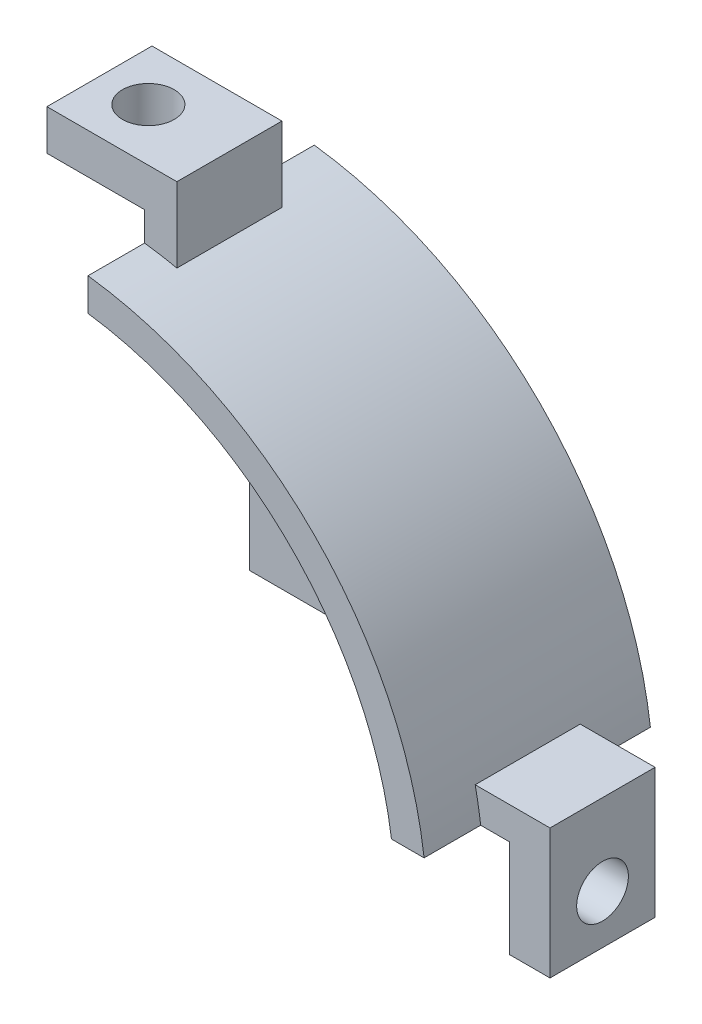
ISO-10303-21;
HEADER;
FILE_DESCRIPTION(('STEP AP214'),'2;1');
FILE_NAME('part.step','',(''),(''),'','','');
FILE_SCHEMA(('AUTOMOTIVE_DESIGN { 1 0 10303 214 1 1 1 1 }'));
ENDSEC;
DATA;
#1=APPLICATION_CONTEXT('core data for automotive mechanical design processes');
#2=APPLICATION_PROTOCOL_DEFINITION('international standard','automotive_design',2000,#1);
#3=PRODUCT_CONTEXT('',#1,'mechanical');
#4=PRODUCT('Part','Part','',(#3));
#5=PRODUCT_RELATED_PRODUCT_CATEGORY('part','',(#4));
#6=PRODUCT_DEFINITION_FORMATION('','',#4);
#7=PRODUCT_DEFINITION_CONTEXT('part definition',#1,'design');
#8=PRODUCT_DEFINITION('design','',#6,#7);
#9=PRODUCT_DEFINITION_SHAPE('','',#8);
#10=(LENGTH_UNIT() NAMED_UNIT(*) SI_UNIT(.MILLI.,.METRE.));
#11=(NAMED_UNIT(*) PLANE_ANGLE_UNIT() SI_UNIT($,.RADIAN.));
#12=(NAMED_UNIT(*) SI_UNIT($,.STERADIAN.) SOLID_ANGLE_UNIT());
#13=UNCERTAINTY_MEASURE_WITH_UNIT(LENGTH_MEASURE(1.E-05),#10,'distance_accuracy_value','');
#14=(GEOMETRIC_REPRESENTATION_CONTEXT(3) GLOBAL_UNCERTAINTY_ASSIGNED_CONTEXT((#13)) GLOBAL_UNIT_ASSIGNED_CONTEXT((#10,
#11,#12)) REPRESENTATION_CONTEXT('',''));
#15=CARTESIAN_POINT('',(0.,0.,0.));
#16=DIRECTION('',(0.,0.,1.));
#17=DIRECTION('',(1.,0.,0.));
#18=AXIS2_PLACEMENT_3D('',#15,#16,#17);
#19=CARTESIAN_POINT('',(28.1,-3.025,14.5));
#20=DIRECTION('',(-1.,0.,0.));
#21=DIRECTION('',(0.,0.,1.));
#22=AXIS2_PLACEMENT_3D('',#19,#20,#21);
#23=PLANE('',#22);
#24=DIRECTION('',(0.,-1.,0.));
#25=VECTOR('',#24,1.);
#26=CARTESIAN_POINT('',(28.1,3.025,4.));
#27=LINE('',#26,#25);
#28=CARTESIAN_POINT('',(28.1,5.015,4.));
#29=VERTEX_POINT('',#28);
#30=CARTESIAN_POINT('',(28.1,-3.025,4.));
#31=VERTEX_POINT('',#30);
#32=EDGE_CURVE('E251',#29,#31,#27,.T.);
#33=ORIENTED_EDGE('',*,*,#32,.F.);
#34=DIRECTION('',(0.,0.,1.));
#35=VECTOR('',#34,1.);
#36=CARTESIAN_POINT('',(28.1,5.015,-6.));
#37=LINE('',#36,#35);
#38=CARTESIAN_POINT('',(28.1,5.015,10.5));
#39=VERTEX_POINT('',#38);
#40=EDGE_CURVE('E216',#29,#39,#37,.T.);
#41=ORIENTED_EDGE('',*,*,#40,.T.);
#42=DIRECTION('',(0.,1.,0.));
#43=VECTOR('',#42,1.);
#44=CARTESIAN_POINT('',(28.1,-3.025,10.5));
#45=LINE('',#44,#43);
#46=CARTESIAN_POINT('',(28.1,-3.025,10.5));
#47=VERTEX_POINT('',#46);
#48=EDGE_CURVE('E252',#47,#39,#45,.T.);
#49=ORIENTED_EDGE('',*,*,#48,.F.);
#50=DIRECTION('',(0.,0.,-1.));
#51=VECTOR('',#50,1.);
#52=CARTESIAN_POINT('',(28.1,-3.025,14.5));
#53=LINE('',#52,#51);
#54=EDGE_CURVE('E292',#47,#31,#53,.T.);
#55=ORIENTED_EDGE('',*,*,#54,.T.);
#56=EDGE_LOOP('',(#33,#41,#49,#55));
#57=FACE_BOUND('',#56,.T.);
#58=CARTESIAN_POINT('',(28.1,0.,7.25));
#59=DIRECTION('',(1.,0.,0.));
#60=DIRECTION('',(0.,0.,-1.));
#61=AXIS2_PLACEMENT_3D('',#58,#59,#60);
#62=CIRCLE('',#61,1.59999999999999);
#63=CARTESIAN_POINT('',(28.1,0.,5.65000000000002));
#64=VERTEX_POINT('',#63);
#65=EDGE_CURVE('E277',#64,#64,#62,.T.);
#66=ORIENTED_EDGE('',*,*,#65,.F.);
#67=EDGE_LOOP('',(#66));
#68=FACE_BOUND('',#67,.T.);
#69=ADVANCED_FACE('F33',(#57,#68),#23,.F.);
#70=CARTESIAN_POINT('',(25.6,-3.025,14.5));
#71=DIRECTION('',(1.,0.,0.));
#72=DIRECTION('',(0.,0.,-1.));
#73=AXIS2_PLACEMENT_3D('',#70,#71,#72);
#74=PLANE('',#73);
#75=CARTESIAN_POINT('',(25.6,0.,7.25));
#76=DIRECTION('',(1.,0.,0.));
#77=DIRECTION('',(0.,0.,-1.));
#78=AXIS2_PLACEMENT_3D('',#75,#76,#77);
#79=CIRCLE('',#78,1.59999999999999);
#80=CARTESIAN_POINT('',(25.6,0.,5.65000000000001));
#81=VERTEX_POINT('',#80);
#82=EDGE_CURVE('E280',#81,#81,#79,.T.);
#83=ORIENTED_EDGE('',*,*,#82,.T.);
#84=EDGE_LOOP('',(#83));
#85=FACE_BOUND('',#84,.T.);
#86=DIRECTION('',(0.,1.,0.));
#87=VECTOR('',#86,1.);
#88=CARTESIAN_POINT('',(25.6,-3.025,10.5));
#89=LINE('',#88,#87);
#90=CARTESIAN_POINT('',(25.6,-3.025,10.5));
#91=VERTEX_POINT('',#90);
#92=CARTESIAN_POINT('',(25.6,3.015,10.5));
#93=VERTEX_POINT('',#92);
#94=EDGE_CURVE('E262',#91,#93,#89,.T.);
#95=ORIENTED_EDGE('',*,*,#94,.T.);
#96=DIRECTION('',(0.,0.,-1.));
#97=VECTOR('',#96,1.);
#98=CARTESIAN_POINT('',(25.6,3.015,14.5));
#99=LINE('',#98,#97);
#100=CARTESIAN_POINT('',(25.6,3.015,4.));
#101=VERTEX_POINT('',#100);
#102=EDGE_CURVE('E246',#93,#101,#99,.T.);
#103=ORIENTED_EDGE('',*,*,#102,.T.);
#104=DIRECTION('',(0.,-1.,0.));
#105=VECTOR('',#104,1.);
#106=CARTESIAN_POINT('',(25.6,-3.025,4.));
#107=LINE('',#106,#105);
#108=CARTESIAN_POINT('',(25.6,-3.025,4.));
#109=VERTEX_POINT('',#108);
#110=EDGE_CURVE('E257',#101,#109,#107,.T.);
#111=ORIENTED_EDGE('',*,*,#110,.T.);
#112=DIRECTION('',(0.,0.,-1.));
#113=VECTOR('',#112,1.);
#114=CARTESIAN_POINT('',(25.6,-3.025,14.5));
#115=LINE('',#114,#113);
#116=EDGE_CURVE('E295',#91,#109,#115,.T.);
#117=ORIENTED_EDGE('',*,*,#116,.F.);
#118=EDGE_LOOP('',(#95,#103,#111,#117));
#119=FACE_BOUND('',#118,.T.);
#120=ADVANCED_FACE('F347',(#85,#119),#74,.F.);
#121=CARTESIAN_POINT('',(25.6,-3.025,14.5));
#122=DIRECTION('',(0.,1.,0.));
#123=DIRECTION('',(0.,0.,1.));
#124=AXIS2_PLACEMENT_3D('',#121,#122,#123);
#125=PLANE('',#124);
#126=ORIENTED_EDGE('',*,*,#54,.F.);
#127=DIRECTION('',(1.,0.,0.));
#128=VECTOR('',#127,1.);
#129=CARTESIAN_POINT('',(18.1,-3.025,10.5));
#130=LINE('',#129,#128);
#131=EDGE_CURVE('E254',#91,#47,#130,.T.);
#132=ORIENTED_EDGE('',*,*,#131,.F.);
#133=ORIENTED_EDGE('',*,*,#116,.T.);
#134=DIRECTION('',(1.,0.,0.));
#135=VECTOR('',#134,1.);
#136=CARTESIAN_POINT('',(18.1,-3.025,4.));
#137=LINE('',#136,#135);
#138=EDGE_CURVE('E255',#109,#31,#137,.T.);
#139=ORIENTED_EDGE('',*,*,#138,.T.);
#140=EDGE_LOOP('',(#126,#132,#133,#139));
#141=FACE_BOUND('',#140,.T.);
#142=ADVANCED_FACE('F351',(#141),#125,.F.);
#143=CARTESIAN_POINT('',(28.1,0.,7.25));
#144=DIRECTION('',(1.,0.,0.));
#145=DIRECTION('',(0.,0.,-1.));
#146=AXIS2_PLACEMENT_3D('',#143,#144,#145);
#147=CYLINDRICAL_SURFACE('',#146,1.59999999999999);
#148=ORIENTED_EDGE('',*,*,#82,.F.);
#149=EDGE_LOOP('',(#148));
#150=FACE_BOUND('',#149,.T.);
#151=ORIENTED_EDGE('',*,*,#65,.T.);
#152=EDGE_LOOP('',(#151));
#153=FACE_BOUND('',#152,.T.);
#154=ADVANCED_FACE('F359',(#150,#153),#147,.F.);
#155=CARTESIAN_POINT('',(18.1,3.025,4.));
#156=DIRECTION('',(0.,0.,1.));
#157=DIRECTION('',(0.,-1.,0.));
#158=AXIS2_PLACEMENT_3D('',#155,#156,#157);
#159=PLANE('',#158);
#160=ORIENTED_EDGE('',*,*,#110,.F.);
#161=DIRECTION('',(1.,0.,0.));
#162=VECTOR('',#161,1.);
#163=CARTESIAN_POINT('',(-3.026,3.015,4.));
#164=LINE('',#163,#162);
#165=CARTESIAN_POINT('',(23.809867177286,3.015,4.));
#166=VERTEX_POINT('',#165);
#167=EDGE_CURVE('E191',#166,#101,#164,.T.);
#168=ORIENTED_EDGE('',*,*,#167,.F.);
#169=CARTESIAN_POINT('',(0.,0.,4.));
#170=DIRECTION('',(0.,0.,1.));
#171=DIRECTION('',(1.,0.,0.));
#172=AXIS2_PLACEMENT_3D('',#169,#170,#171);
#173=CIRCLE('',#172,24.);
#174=CARTESIAN_POINT('',(23.4701890703931,5.015,4.));
#175=VERTEX_POINT('',#174);
#176=EDGE_CURVE('E192',#175,#166,#173,.F.);
#177=ORIENTED_EDGE('',*,*,#176,.F.);
#178=DIRECTION('',(1.,0.,0.));
#179=VECTOR('',#178,1.);
#180=CARTESIAN_POINT('',(-3.026,5.015,4.));
#181=LINE('',#180,#179);
#182=EDGE_CURVE('E195',#175,#29,#181,.T.);
#183=ORIENTED_EDGE('',*,*,#182,.T.);
#184=ORIENTED_EDGE('',*,*,#32,.T.);
#185=ORIENTED_EDGE('',*,*,#138,.F.);
#186=EDGE_LOOP('',(#160,#168,#177,#183,#184,#185));
#187=FACE_BOUND('',#186,.T.);
#188=ADVANCED_FACE('F344',(#187),#159,.F.);
#189=CARTESIAN_POINT('',(18.1,-3.025,10.5));
#190=DIRECTION('',(0.,0.,-1.));
#191=DIRECTION('',(-1.,0.,0.));
#192=AXIS2_PLACEMENT_3D('',#189,#190,#191);
#193=PLANE('',#192);
#194=ORIENTED_EDGE('',*,*,#48,.T.);
#195=DIRECTION('',(1.,0.,0.));
#196=VECTOR('',#195,1.);
#197=CARTESIAN_POINT('',(-3.026,5.015,10.5));
#198=LINE('',#197,#196);
#199=CARTESIAN_POINT('',(23.4701890703931,5.015,10.5));
#200=VERTEX_POINT('',#199);
#201=EDGE_CURVE('E199',#200,#39,#198,.T.);
#202=ORIENTED_EDGE('',*,*,#201,.F.);
#203=CARTESIAN_POINT('',(0.,0.,10.5));
#204=DIRECTION('',(0.,0.,-1.));
#205=DIRECTION('',(-1.,0.,0.));
#206=AXIS2_PLACEMENT_3D('',#203,#204,#205);
#207=CIRCLE('',#206,24.);
#208=CARTESIAN_POINT('',(23.809867177286,3.015,10.5));
#209=VERTEX_POINT('',#208);
#210=EDGE_CURVE('E203',#209,#200,#207,.F.);
#211=ORIENTED_EDGE('',*,*,#210,.F.);
#212=DIRECTION('',(1.,0.,0.));
#213=VECTOR('',#212,1.);
#214=CARTESIAN_POINT('',(-3.026,3.015,10.5));
#215=LINE('',#214,#213);
#216=EDGE_CURVE('E202',#209,#93,#215,.T.);
#217=ORIENTED_EDGE('',*,*,#216,.T.);
#218=ORIENTED_EDGE('',*,*,#94,.F.);
#219=ORIENTED_EDGE('',*,*,#131,.T.);
#220=EDGE_LOOP('',(#194,#202,#211,#217,#218,#219));
#221=FACE_BOUND('',#220,.T.);
#222=ADVANCED_FACE('F335',(#221),#193,.F.);
#223=CARTESIAN_POINT('',(3.015,3.015,14.));
#224=DIRECTION('',(-1.,0.,0.));
#225=DIRECTION('',(0.,0.,1.));
#226=AXIS2_PLACEMENT_3D('',#223,#224,#225);
#227=PLANE('',#226);
#228=DIRECTION('',(0.,0.,1.));
#229=VECTOR('',#228,1.);
#230=CARTESIAN_POINT('',(3.015,23.809867177286,-6.));
#231=LINE('',#230,#229);
#232=CARTESIAN_POINT('',(3.015,23.809867177286,10.5));
#233=VERTEX_POINT('',#232);
#234=CARTESIAN_POINT('',(3.015,23.809867177286,14.));
#235=VERTEX_POINT('',#234);
#236=EDGE_CURVE('E158',#233,#235,#231,.T.);
#237=ORIENTED_EDGE('',*,*,#236,.F.);
#238=DIRECTION('',(0.,1.,0.));
#239=VECTOR('',#238,1.);
#240=CARTESIAN_POINT('',(3.015,-3.026,10.5));
#241=LINE('',#240,#239);
#242=CARTESIAN_POINT('',(3.015,25.6,10.5));
#243=VERTEX_POINT('',#242);
#244=EDGE_CURVE('E150',#233,#243,#241,.T.);
#245=ORIENTED_EDGE('',*,*,#244,.T.);
#246=DIRECTION('',(0.,0.,1.));
#247=VECTOR('',#246,1.);
#248=CARTESIAN_POINT('',(3.015,25.6,14.5));
#249=LINE('',#248,#247);
#250=CARTESIAN_POINT('',(3.015,25.6,4.));
#251=VERTEX_POINT('',#250);
#252=EDGE_CURVE('E249',#251,#243,#249,.T.);
#253=ORIENTED_EDGE('',*,*,#252,.F.);
#254=DIRECTION('',(0.,1.,0.));
#255=VECTOR('',#254,1.);
#256=CARTESIAN_POINT('',(3.015,-3.026,4.));
#257=LINE('',#256,#255);
#258=CARTESIAN_POINT('',(3.015,23.809867177286,4.));
#259=VERTEX_POINT('',#258);
#260=EDGE_CURVE('E181',#259,#251,#257,.T.);
#261=ORIENTED_EDGE('',*,*,#260,.F.);
#262=DIRECTION('',(0.,0.,1.));
#263=VECTOR('',#262,1.);
#264=CARTESIAN_POINT('',(3.015,23.809867177286,-6.));
#265=LINE('',#264,#263);
#266=CARTESIAN_POINT('',(3.015,23.809867177286,0.));
#267=VERTEX_POINT('',#266);
#268=EDGE_CURVE('E182',#267,#259,#265,.T.);
#269=ORIENTED_EDGE('',*,*,#268,.F.);
#270=DIRECTION('',(0.,1.,0.));
#271=VECTOR('',#270,1.);
#272=CARTESIAN_POINT('',(3.015,3.015,0.));
#273=LINE('',#272,#271);
#274=CARTESIAN_POINT('',(3.015,3.015,0.));
#275=VERTEX_POINT('',#274);
#276=EDGE_CURVE('E238',#275,#267,#273,.T.);
#277=ORIENTED_EDGE('',*,*,#276,.F.);
#278=DIRECTION('',(0.,0.,-1.));
#279=VECTOR('',#278,1.);
#280=CARTESIAN_POINT('',(3.015,3.015,14.));
#281=LINE('',#280,#279);
#282=CARTESIAN_POINT('',(3.015,3.015,4.));
#283=VERTEX_POINT('',#282);
#284=EDGE_CURVE('E240',#283,#275,#281,.T.);
#285=ORIENTED_EDGE('',*,*,#284,.F.);
#286=DIRECTION('',(0.,-1.,0.));
#287=VECTOR('',#286,1.);
#288=CARTESIAN_POINT('',(3.015,21.792424715942,4.));
#289=LINE('',#288,#287);
#290=CARTESIAN_POINT('',(3.015,21.792424715942,4.));
#291=VERTEX_POINT('',#290);
#292=EDGE_CURVE('E224',#291,#283,#289,.T.);
#293=ORIENTED_EDGE('',*,*,#292,.F.);
#294=DIRECTION('',(0.,0.,1.));
#295=VECTOR('',#294,1.);
#296=CARTESIAN_POINT('',(3.015,21.792424715942,4.));
#297=LINE('',#296,#295);
#298=CARTESIAN_POINT('',(3.015,21.792424715942,14.));
#299=VERTEX_POINT('',#298);
#300=EDGE_CURVE('E229',#291,#299,#297,.T.);
#301=ORIENTED_EDGE('',*,*,#300,.T.);
#302=DIRECTION('',(0.,1.,0.));
#303=VECTOR('',#302,1.);
#304=CARTESIAN_POINT('',(3.015,3.015,14.));
#305=LINE('',#304,#303);
#306=EDGE_CURVE('E173',#299,#235,#305,.T.);
#307=ORIENTED_EDGE('',*,*,#306,.T.);
#308=EDGE_LOOP('',(#237,#245,#253,#261,#269,#277,#285,#293,#301,#307));
#309=FACE_BOUND('',#308,.T.);
#310=ADVANCED_FACE('F170',(#309),#227,.T.);
#311=CARTESIAN_POINT('',(31.0354197299389,3.015,14.));
#312=DIRECTION('',(0.,-1.,0.));
#313=DIRECTION('',(0.,0.,-1.));
#314=AXIS2_PLACEMENT_3D('',#311,#312,#313);
#315=PLANE('',#314);
#316=DIRECTION('',(0.,0.,1.));
#317=VECTOR('',#316,1.);
#318=CARTESIAN_POINT('',(23.809867177286,3.015,-6.));
#319=LINE('',#318,#317);
#320=CARTESIAN_POINT('',(23.809867177286,3.015,0.));
#321=VERTEX_POINT('',#320);
#322=EDGE_CURVE('E187',#166,#321,#319,.F.);
#323=ORIENTED_EDGE('',*,*,#322,.F.);
#324=ORIENTED_EDGE('',*,*,#167,.T.);
#325=ORIENTED_EDGE('',*,*,#102,.F.);
#326=ORIENTED_EDGE('',*,*,#216,.F.);
#327=DIRECTION('',(0.,0.,1.));
#328=VECTOR('',#327,1.);
#329=CARTESIAN_POINT('',(23.809867177286,3.015,-6.));
#330=LINE('',#329,#328);
#331=CARTESIAN_POINT('',(23.809867177286,3.015,14.));
#332=VERTEX_POINT('',#331);
#333=EDGE_CURVE('E176',#332,#209,#330,.F.);
#334=ORIENTED_EDGE('',*,*,#333,.F.);
#335=DIRECTION('',(-1.,0.,0.));
#336=VECTOR('',#335,1.);
#337=CARTESIAN_POINT('',(31.0354197299389,3.015,14.));
#338=LINE('',#337,#336);
#339=CARTESIAN_POINT('',(21.792424715942,3.015,14.));
#340=VERTEX_POINT('',#339);
#341=EDGE_CURVE('E236',#332,#340,#338,.T.);
#342=ORIENTED_EDGE('',*,*,#341,.T.);
#343=DIRECTION('',(0.,0.,1.));
#344=VECTOR('',#343,1.);
#345=CARTESIAN_POINT('',(21.792424715942,3.015,4.));
#346=LINE('',#345,#344);
#347=CARTESIAN_POINT('',(21.792424715942,3.015,4.));
#348=VERTEX_POINT('',#347);
#349=EDGE_CURVE('E231',#348,#340,#346,.T.);
#350=ORIENTED_EDGE('',*,*,#349,.F.);
#351=DIRECTION('',(1.,0.,0.));
#352=VECTOR('',#351,1.);
#353=CARTESIAN_POINT('',(3.015,3.015,4.));
#354=LINE('',#353,#352);
#355=EDGE_CURVE('E226',#283,#348,#354,.T.);
#356=ORIENTED_EDGE('',*,*,#355,.F.);
#357=ORIENTED_EDGE('',*,*,#284,.T.);
#358=DIRECTION('',(-1.,0.,0.));
#359=VECTOR('',#358,1.);
#360=CARTESIAN_POINT('',(31.0354197299389,3.015,0.));
#361=LINE('',#360,#359);
#362=EDGE_CURVE('E234',#321,#275,#361,.T.);
#363=ORIENTED_EDGE('',*,*,#362,.F.);
#364=EDGE_LOOP('',(#323,#324,#325,#326,#334,#342,#350,#356,#357,#363));
#365=FACE_BOUND('',#364,.T.);
#366=ADVANCED_FACE('F320',(#365),#315,.T.);
#367=CARTESIAN_POINT('',(0.,0.,14.));
#368=DIRECTION('',(0.,0.,-1.));
#369=DIRECTION('',(-1.,0.,0.));
#370=AXIS2_PLACEMENT_3D('',#367,#368,#369);
#371=PLANE('',#370);
#372=CARTESIAN_POINT('',(0.,0.,14.));
#373=DIRECTION('',(0.,0.,-1.));
#374=DIRECTION('',(1.,0.,0.));
#375=AXIS2_PLACEMENT_3D('',#372,#373,#374);
#376=CIRCLE('',#375,24.);
#377=EDGE_CURVE('E190',#235,#332,#376,.T.);
#378=ORIENTED_EDGE('',*,*,#377,.F.);
#379=ORIENTED_EDGE('',*,*,#306,.F.);
#380=CARTESIAN_POINT('',(0.,0.,14.));
#381=DIRECTION('',(0.,0.,1.));
#382=DIRECTION('',(-1.,0.,0.));
#383=AXIS2_PLACEMENT_3D('',#380,#381,#382);
#384=CIRCLE('',#383,22.);
#385=EDGE_CURVE('E212',#340,#299,#384,.T.);
#386=ORIENTED_EDGE('',*,*,#385,.F.);
#387=ORIENTED_EDGE('',*,*,#341,.F.);
#388=EDGE_LOOP('',(#378,#379,#386,#387));
#389=FACE_BOUND('',#388,.T.);
#390=ADVANCED_FACE('F330',(#389),#371,.F.);
#391=CARTESIAN_POINT('',(4.76778044648797,4.76778044648796,0.));
#392=DIRECTION('',(0.,0.,-1.));
#393=DIRECTION('',(-1.,0.,0.));
#394=AXIS2_PLACEMENT_3D('',#391,#392,#393);
#395=PLANE('',#394);
#396=ORIENTED_EDGE('',*,*,#276,.T.);
#397=CARTESIAN_POINT('',(0.,0.,0.));
#398=DIRECTION('',(0.,0.,-1.));
#399=DIRECTION('',(-1.,0.,0.));
#400=AXIS2_PLACEMENT_3D('',#397,#398,#399);
#401=CIRCLE('',#400,24.);
#402=EDGE_CURVE('E11',#321,#267,#401,.F.);
#403=ORIENTED_EDGE('',*,*,#402,.F.);
#404=ORIENTED_EDGE('',*,*,#362,.T.);
#405=EDGE_LOOP('',(#396,#403,#404));
#406=FACE_BOUND('',#405,.T.);
#407=ADVANCED_FACE('F315',(#406),#395,.T.);
#408=CARTESIAN_POINT('',(0.,28.1,7.25));
#409=DIRECTION('',(0.,1.,0.));
#410=DIRECTION('',(0.,0.,1.));
#411=AXIS2_PLACEMENT_3D('',#408,#409,#410);
#412=CYLINDRICAL_SURFACE('',#411,1.59999999999999);
#413=CARTESIAN_POINT('',(0.,25.6,7.25));
#414=DIRECTION('',(0.,1.,0.));
#415=DIRECTION('',(-1.,0.,0.));
#416=AXIS2_PLACEMENT_3D('',#413,#414,#415);
#417=CIRCLE('',#416,1.59999999999999);
#418=CARTESIAN_POINT('',(-1.59999999999999,25.6,7.25));
#419=VERTEX_POINT('',#418);
#420=EDGE_CURVE('E286',#419,#419,#417,.T.);
#421=ORIENTED_EDGE('',*,*,#420,.F.);
#422=EDGE_LOOP('',(#421));
#423=FACE_BOUND('',#422,.T.);
#424=CARTESIAN_POINT('',(0.,28.1,7.25));
#425=DIRECTION('',(0.,1.,0.));
#426=DIRECTION('',(0.,0.,1.));
#427=AXIS2_PLACEMENT_3D('',#424,#425,#426);
#428=CIRCLE('',#427,1.59999999999999);
#429=CARTESIAN_POINT('',(0.,28.1,8.84999999999999));
#430=VERTEX_POINT('',#429);
#431=EDGE_CURVE('E283',#430,#430,#428,.T.);
#432=ORIENTED_EDGE('',*,*,#431,.T.);
#433=EDGE_LOOP('',(#432));
#434=FACE_BOUND('',#433,.T.);
#435=ADVANCED_FACE('F373',(#423,#434),#412,.F.);
#436=CARTESIAN_POINT('',(-3.025,25.6,14.5));
#437=DIRECTION('',(1.,0.,0.));
#438=DIRECTION('',(0.,0.,-1.));
#439=AXIS2_PLACEMENT_3D('',#436,#437,#438);
#440=PLANE('',#439);
#441=DIRECTION('',(0.,0.,-1.));
#442=VECTOR('',#441,1.);
#443=CARTESIAN_POINT('',(-3.025,25.6,14.5));
#444=LINE('',#443,#442);
#445=CARTESIAN_POINT('',(-3.025,25.6,10.5));
#446=VERTEX_POINT('',#445);
#447=CARTESIAN_POINT('',(-3.025,25.6,4.));
#448=VERTEX_POINT('',#447);
#449=EDGE_CURVE('E41',#446,#448,#444,.T.);
#450=ORIENTED_EDGE('',*,*,#449,.F.);
#451=DIRECTION('',(0.,1.,0.));
#452=VECTOR('',#451,1.);
#453=CARTESIAN_POINT('',(-3.025,18.1,10.5));
#454=LINE('',#453,#452);
#455=CARTESIAN_POINT('',(-3.025,28.1,10.5));
#456=VERTEX_POINT('',#455);
#457=EDGE_CURVE('E267',#446,#456,#454,.T.);
#458=ORIENTED_EDGE('',*,*,#457,.T.);
#459=DIRECTION('',(0.,0.,-1.));
#460=VECTOR('',#459,1.);
#461=CARTESIAN_POINT('',(-3.025,28.1,14.5));
#462=LINE('',#461,#460);
#463=CARTESIAN_POINT('',(-3.025,28.1,4.));
#464=VERTEX_POINT('',#463);
#465=EDGE_CURVE('E289',#456,#464,#462,.T.);
#466=ORIENTED_EDGE('',*,*,#465,.T.);
#467=DIRECTION('',(0.,1.,0.));
#468=VECTOR('',#467,1.);
#469=CARTESIAN_POINT('',(-3.025,18.1,4.));
#470=LINE('',#469,#468);
#471=EDGE_CURVE('E268',#448,#464,#470,.T.);
#472=ORIENTED_EDGE('',*,*,#471,.F.);
#473=EDGE_LOOP('',(#450,#458,#466,#472));
#474=FACE_BOUND('',#473,.T.);
#475=ADVANCED_FACE('F35',(#474),#440,.F.);
#476=CARTESIAN_POINT('',(-3.025,18.1,4.));
#477=DIRECTION('',(0.,0.,1.));
#478=DIRECTION('',(1.,0.,0.));
#479=AXIS2_PLACEMENT_3D('',#476,#477,#478);
#480=PLANE('',#479);
#481=DIRECTION('',(1.,0.,0.));
#482=VECTOR('',#481,1.);
#483=CARTESIAN_POINT('',(-3.025,28.1,4.));
#484=LINE('',#483,#482);
#485=CARTESIAN_POINT('',(5.015,28.1,4.));
#486=VERTEX_POINT('',#485);
#487=EDGE_CURVE('E56',#464,#486,#484,.T.);
#488=ORIENTED_EDGE('',*,*,#487,.T.);
#489=DIRECTION('',(0.,1.,0.));
#490=VECTOR('',#489,1.);
#491=CARTESIAN_POINT('',(5.015,-3.026,4.));
#492=LINE('',#491,#490);
#493=CARTESIAN_POINT('',(5.015,23.4701890703931,4.));
#494=VERTEX_POINT('',#493);
#495=EDGE_CURVE('E168',#494,#486,#492,.T.);
#496=ORIENTED_EDGE('',*,*,#495,.F.);
#497=CARTESIAN_POINT('',(0.,0.,4.));
#498=DIRECTION('',(0.,0.,1.));
#499=DIRECTION('',(1.,0.,0.));
#500=AXIS2_PLACEMENT_3D('',#497,#498,#499);
#501=CIRCLE('',#500,24.);
#502=EDGE_CURVE('E179',#259,#494,#501,.F.);
#503=ORIENTED_EDGE('',*,*,#502,.F.);
#504=ORIENTED_EDGE('',*,*,#260,.T.);
#505=DIRECTION('',(1.,0.,0.));
#506=VECTOR('',#505,1.);
#507=CARTESIAN_POINT('',(3.025,25.6,4.));
#508=LINE('',#507,#506);
#509=EDGE_CURVE('E271',#448,#251,#508,.T.);
#510=ORIENTED_EDGE('',*,*,#509,.F.);
#511=ORIENTED_EDGE('',*,*,#471,.T.);
#512=EDGE_LOOP('',(#488,#496,#503,#504,#510,#511));
#513=FACE_BOUND('',#512,.T.);
#514=ADVANCED_FACE('F304',(#513),#480,.F.);
#515=CARTESIAN_POINT('',(3.02500000000022,18.1,10.5));
#516=DIRECTION('',(0.,0.,-1.));
#517=DIRECTION('',(-1.,0.,0.));
#518=AXIS2_PLACEMENT_3D('',#515,#516,#517);
#519=PLANE('',#518);
#520=DIRECTION('',(-1.,0.,0.));
#521=VECTOR('',#520,1.);
#522=CARTESIAN_POINT('',(3.025,25.6,10.5));
#523=LINE('',#522,#521);
#524=EDGE_CURVE('E153',#243,#446,#523,.T.);
#525=ORIENTED_EDGE('',*,*,#524,.F.);
#526=ORIENTED_EDGE('',*,*,#244,.F.);
#527=CARTESIAN_POINT('',(0.,0.,10.5));
#528=DIRECTION('',(0.,0.,-1.));
#529=DIRECTION('',(-1.,0.,0.));
#530=AXIS2_PLACEMENT_3D('',#527,#528,#529);
#531=CIRCLE('',#530,24.);
#532=CARTESIAN_POINT('',(5.015,23.4701890703931,10.5));
#533=VERTEX_POINT('',#532);
#534=EDGE_CURVE('E48',#533,#233,#531,.F.);
#535=ORIENTED_EDGE('',*,*,#534,.F.);
#536=DIRECTION('',(0.,1.,0.));
#537=VECTOR('',#536,1.);
#538=CARTESIAN_POINT('',(5.015,-3.026,10.5));
#539=LINE('',#538,#537);
#540=CARTESIAN_POINT('',(5.015,28.1,10.5));
#541=VERTEX_POINT('',#540);
#542=EDGE_CURVE('E174',#533,#541,#539,.T.);
#543=ORIENTED_EDGE('',*,*,#542,.T.);
#544=DIRECTION('',(-1.,0.,0.));
#545=VECTOR('',#544,1.);
#546=CARTESIAN_POINT('',(3.02500000000022,28.1,10.5));
#547=LINE('',#546,#545);
#548=EDGE_CURVE('E265',#541,#456,#547,.T.);
#549=ORIENTED_EDGE('',*,*,#548,.T.);
#550=ORIENTED_EDGE('',*,*,#457,.F.);
#551=EDGE_LOOP('',(#525,#526,#535,#543,#549,#550));
#552=FACE_BOUND('',#551,.T.);
#553=ADVANCED_FACE('F151',(#552),#519,.F.);
#554=CARTESIAN_POINT('',(-3.025,28.1,14.5));
#555=DIRECTION('',(0.,-1.,0.));
#556=DIRECTION('',(0.,0.,-1.));
#557=AXIS2_PLACEMENT_3D('',#554,#555,#556);
#558=PLANE('',#557);
#559=ORIENTED_EDGE('',*,*,#431,.F.);
#560=EDGE_LOOP('',(#559));
#561=FACE_BOUND('',#560,.T.);
#562=ORIENTED_EDGE('',*,*,#548,.F.);
#563=DIRECTION('',(0.,0.,1.));
#564=VECTOR('',#563,1.);
#565=CARTESIAN_POINT('',(5.015,28.1,-6.));
#566=LINE('',#565,#564);
#567=EDGE_CURVE('E213',#486,#541,#566,.T.);
#568=ORIENTED_EDGE('',*,*,#567,.F.);
#569=ORIENTED_EDGE('',*,*,#487,.F.);
#570=ORIENTED_EDGE('',*,*,#465,.F.);
#571=EDGE_LOOP('',(#562,#568,#569,#570));
#572=FACE_BOUND('',#571,.T.);
#573=ADVANCED_FACE('F307',(#561,#572),#558,.F.);
#574=CARTESIAN_POINT('',(3.025,25.6,14.5));
#575=DIRECTION('',(0.,1.,0.));
#576=DIRECTION('',(-1.,0.,0.));
#577=AXIS2_PLACEMENT_3D('',#574,#575,#576);
#578=PLANE('',#577);
#579=ORIENTED_EDGE('',*,*,#420,.T.);
#580=EDGE_LOOP('',(#579));
#581=FACE_BOUND('',#580,.T.);
#582=ORIENTED_EDGE('',*,*,#509,.T.);
#583=ORIENTED_EDGE('',*,*,#252,.T.);
#584=ORIENTED_EDGE('',*,*,#524,.T.);
#585=ORIENTED_EDGE('',*,*,#449,.T.);
#586=EDGE_LOOP('',(#582,#583,#584,#585));
#587=FACE_BOUND('',#586,.T.);
#588=ADVANCED_FACE('F300',(#581,#587),#578,.F.);
#589=CARTESIAN_POINT('',(0.,0.,4.));
#590=DIRECTION('',(0.,0.,1.));
#591=DIRECTION('',(1.,0.,0.));
#592=AXIS2_PLACEMENT_3D('',#589,#590,#591);
#593=CYLINDRICAL_SURFACE('',#592,22.);
#594=ORIENTED_EDGE('',*,*,#385,.T.);
#595=ORIENTED_EDGE('',*,*,#300,.F.);
#596=CARTESIAN_POINT('',(0.,0.,4.));
#597=DIRECTION('',(0.,0.,1.));
#598=DIRECTION('',(-1.,0.,0.));
#599=AXIS2_PLACEMENT_3D('',#596,#597,#598);
#600=CIRCLE('',#599,22.);
#601=EDGE_CURVE('E221',#348,#291,#600,.T.);
#602=ORIENTED_EDGE('',*,*,#601,.F.);
#603=ORIENTED_EDGE('',*,*,#349,.T.);
#604=EDGE_LOOP('',(#594,#595,#602,#603));
#605=FACE_BOUND('',#604,.T.);
#606=ADVANCED_FACE('F326',(#605),#593,.F.);
#607=CARTESIAN_POINT('',(0.,0.,4.));
#608=DIRECTION('',(0.,0.,-1.));
#609=DIRECTION('',(-1.,0.,0.));
#610=AXIS2_PLACEMENT_3D('',#607,#608,#609);
#611=PLANE('',#610);
#612=ORIENTED_EDGE('',*,*,#601,.T.);
#613=ORIENTED_EDGE('',*,*,#292,.T.);
#614=ORIENTED_EDGE('',*,*,#355,.T.);
#615=EDGE_LOOP('',(#612,#613,#614));
#616=FACE_BOUND('',#615,.T.);
#617=ADVANCED_FACE('F324',(#616),#611,.F.);
#618=CARTESIAN_POINT('',(0.,0.,-6.));
#619=DIRECTION('',(0.,0.,1.));
#620=DIRECTION('',(1.,0.,0.));
#621=AXIS2_PLACEMENT_3D('',#618,#619,#620);
#622=CYLINDRICAL_SURFACE('',#621,24.);
#623=ORIENTED_EDGE('',*,*,#402,.T.);
#624=ORIENTED_EDGE('',*,*,#268,.T.);
#625=ORIENTED_EDGE('',*,*,#502,.T.);
#626=DIRECTION('',(0.,0.,1.));
#627=VECTOR('',#626,1.);
#628=CARTESIAN_POINT('',(5.015,23.4701890703931,-6.));
#629=LINE('',#628,#627);
#630=EDGE_CURVE('E167',#494,#533,#629,.T.);
#631=ORIENTED_EDGE('',*,*,#630,.T.);
#632=ORIENTED_EDGE('',*,*,#534,.T.);
#633=ORIENTED_EDGE('',*,*,#236,.T.);
#634=ORIENTED_EDGE('',*,*,#377,.T.);
#635=ORIENTED_EDGE('',*,*,#333,.T.);
#636=ORIENTED_EDGE('',*,*,#210,.T.);
#637=DIRECTION('',(0.,0.,1.));
#638=VECTOR('',#637,1.);
#639=CARTESIAN_POINT('',(23.4701890703931,5.015,-6.));
#640=LINE('',#639,#638);
#641=EDGE_CURVE('E210',#175,#200,#640,.T.);
#642=ORIENTED_EDGE('',*,*,#641,.F.);
#643=ORIENTED_EDGE('',*,*,#176,.T.);
#644=ORIENTED_EDGE('',*,*,#322,.T.);
#645=EDGE_LOOP('',(#623,#624,#625,#631,#632,#633,#634,#635,#636,#642,#643,#644));
#646=FACE_BOUND('',#645,.T.);
#647=ADVANCED_FACE('F163',(#646),#622,.T.);
#648=CARTESIAN_POINT('',(5.015,23.4701890703931,-6.));
#649=DIRECTION('',(-1.,0.,0.));
#650=DIRECTION('',(0.,-1.,0.));
#651=AXIS2_PLACEMENT_3D('',#648,#649,#650);
#652=PLANE('',#651);
#653=ORIENTED_EDGE('',*,*,#567,.T.);
#654=ORIENTED_EDGE('',*,*,#542,.F.);
#655=ORIENTED_EDGE('',*,*,#630,.F.);
#656=ORIENTED_EDGE('',*,*,#495,.T.);
#657=EDGE_LOOP('',(#653,#654,#655,#656));
#658=FACE_BOUND('',#657,.T.);
#659=ADVANCED_FACE('F309',(#658),#652,.F.);
#660=CARTESIAN_POINT('',(23.4701890703931,5.015,-6.));
#661=DIRECTION('',(0.,-1.,0.));
#662=DIRECTION('',(0.,0.,-1.));
#663=AXIS2_PLACEMENT_3D('',#660,#661,#662);
#664=PLANE('',#663);
#665=ORIENTED_EDGE('',*,*,#40,.F.);
#666=ORIENTED_EDGE('',*,*,#182,.F.);
#667=ORIENTED_EDGE('',*,*,#641,.T.);
#668=ORIENTED_EDGE('',*,*,#201,.T.);
#669=EDGE_LOOP('',(#665,#666,#667,#668));
#670=FACE_BOUND('',#669,.T.);
#671=ADVANCED_FACE('F341',(#670),#664,.F.);
#672=CLOSED_SHELL('',(#69,#120,#142,#154,#188,#222,#310,#366,#390,#407,#435,#475,#514,#553,#573,
#588,#606,#617,#647,#659,#671));
#673=MANIFOLD_SOLID_BREP('B2',#672);
#674=ADVANCED_BREP_SHAPE_REPRESENTATION('',(#18,#673),#14);
#675=SHAPE_DEFINITION_REPRESENTATION(#9,#674);
ENDSEC;
END-ISO-10303-21;
